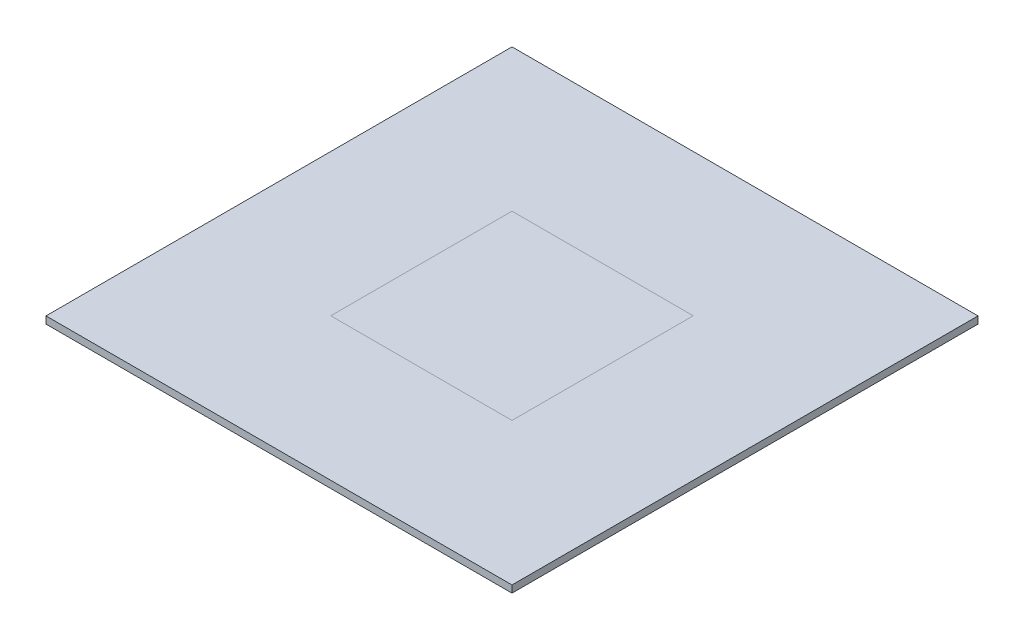
ISO-10303-21;
HEADER;
FILE_DESCRIPTION(('STEP AP214'),'2;1');
FILE_NAME('part.step','',(''),(''),'','','');
FILE_SCHEMA(('AUTOMOTIVE_DESIGN { 1 0 10303 214 1 1 1 1 }'));
ENDSEC;
DATA;
#1=APPLICATION_CONTEXT('core data for automotive mechanical design processes');
#2=APPLICATION_PROTOCOL_DEFINITION('international standard','automotive_design',2000,#1);
#3=PRODUCT_CONTEXT('',#1,'mechanical');
#4=PRODUCT('Part','Part','',(#3));
#5=PRODUCT_RELATED_PRODUCT_CATEGORY('part','',(#4));
#6=PRODUCT_DEFINITION_FORMATION('','',#4);
#7=PRODUCT_DEFINITION_CONTEXT('part definition',#1,'design');
#8=PRODUCT_DEFINITION('design','',#6,#7);
#9=PRODUCT_DEFINITION_SHAPE('','',#8);
#10=(LENGTH_UNIT() NAMED_UNIT(*) SI_UNIT(.MILLI.,.METRE.));
#11=(NAMED_UNIT(*) PLANE_ANGLE_UNIT() SI_UNIT($,.RADIAN.));
#12=(NAMED_UNIT(*) SI_UNIT($,.STERADIAN.) SOLID_ANGLE_UNIT());
#13=UNCERTAINTY_MEASURE_WITH_UNIT(LENGTH_MEASURE(1.E-05),#10,'distance_accuracy_value','');
#14=(GEOMETRIC_REPRESENTATION_CONTEXT(3) GLOBAL_UNCERTAINTY_ASSIGNED_CONTEXT((#13)) GLOBAL_UNIT_ASSIGNED_CONTEXT((#10,
#11,#12)) REPRESENTATION_CONTEXT('',''));
#15=CARTESIAN_POINT('',(0.,0.,0.));
#16=DIRECTION('',(0.,0.,1.));
#17=DIRECTION('',(1.,0.,0.));
#18=AXIS2_PLACEMENT_3D('',#15,#16,#17);
#19=CARTESIAN_POINT('',(0.,1.393,0.));
#20=DIRECTION('',(0.,1.,0.));
#21=DIRECTION('',(0.,0.,1.));
#22=AXIS2_PLACEMENT_3D('',#19,#20,#21);
#23=PLANE('',#22);
#24=DIRECTION('',(0.,0.,-1.));
#25=VECTOR('',#24,1.);
#26=CARTESIAN_POINT('',(17.5,1.393,-17.5));
#27=LINE('',#26,#25);
#28=CARTESIAN_POINT('',(17.5,1.393,17.5));
#29=VERTEX_POINT('',#28);
#30=CARTESIAN_POINT('',(17.5,1.393,-17.5));
#31=VERTEX_POINT('',#30);
#32=EDGE_CURVE('E60',#29,#31,#27,.T.);
#33=ORIENTED_EDGE('',*,*,#32,.T.);
#34=DIRECTION('',(-1.,0.,0.));
#35=VECTOR('',#34,1.);
#36=CARTESIAN_POINT('',(-17.5,1.393,-17.5));
#37=LINE('',#36,#35);
#38=CARTESIAN_POINT('',(-17.5,1.393,-17.5));
#39=VERTEX_POINT('',#38);
#40=EDGE_CURVE('E71',#31,#39,#37,.T.);
#41=ORIENTED_EDGE('',*,*,#40,.T.);
#42=DIRECTION('',(0.,0.,1.));
#43=VECTOR('',#42,1.);
#44=CARTESIAN_POINT('',(-17.5,1.393,-17.5));
#45=LINE('',#44,#43);
#46=CARTESIAN_POINT('',(-17.5,1.393,17.5));
#47=VERTEX_POINT('',#46);
#48=EDGE_CURVE('E56',#39,#47,#45,.T.);
#49=ORIENTED_EDGE('',*,*,#48,.T.);
#50=DIRECTION('',(1.,0.,0.));
#51=VECTOR('',#50,1.);
#52=CARTESIAN_POINT('',(-17.5,1.393,17.5));
#53=LINE('',#52,#51);
#54=EDGE_CURVE('E12',#47,#29,#53,.T.);
#55=ORIENTED_EDGE('',*,*,#54,.T.);
#56=EDGE_LOOP('',(#33,#41,#49,#55));
#57=FACE_BOUND('',#56,.T.);
#58=ADVANCED_FACE('F51',(#57),#23,.T.);
#59=OPEN_SHELL('',(#58));
#60=SHELL_BASED_SURFACE_MODEL('B2',(#59));
#61=CARTESIAN_POINT('',(45.,1.375,-45.));
#62=DIRECTION('',(-1.,0.,0.));
#63=DIRECTION('',(0.,0.,1.));
#64=AXIS2_PLACEMENT_3D('',#61,#62,#63);
#65=PLANE('',#64);
#66=DIRECTION('',(0.,0.,-1.));
#67=VECTOR('',#66,1.);
#68=CARTESIAN_POINT('',(45.,0.,-45.));
#69=LINE('',#68,#67);
#70=CARTESIAN_POINT('',(45.,0.,45.));
#71=VERTEX_POINT('',#70);
#72=CARTESIAN_POINT('',(45.,0.,-45.));
#73=VERTEX_POINT('',#72);
#74=EDGE_CURVE('E158',#71,#73,#69,.T.);
#75=ORIENTED_EDGE('',*,*,#74,.T.);
#76=DIRECTION('',(0.,-1.,0.));
#77=VECTOR('',#76,1.);
#78=CARTESIAN_POINT('',(45.,1.375,-45.));
#79=LINE('',#78,#77);
#80=CARTESIAN_POINT('',(45.,1.375,-45.));
#81=VERTEX_POINT('',#80);
#82=EDGE_CURVE('E49',#81,#73,#79,.T.);
#83=ORIENTED_EDGE('',*,*,#82,.F.);
#84=DIRECTION('',(0.,0.,-1.));
#85=VECTOR('',#84,1.);
#86=CARTESIAN_POINT('',(45.,1.375,-45.));
#87=LINE('',#86,#85);
#88=CARTESIAN_POINT('',(45.,1.375,45.));
#89=VERTEX_POINT('',#88);
#90=EDGE_CURVE('E146',#89,#81,#87,.T.);
#91=ORIENTED_EDGE('',*,*,#90,.F.);
#92=DIRECTION('',(0.,-1.,0.));
#93=VECTOR('',#92,1.);
#94=CARTESIAN_POINT('',(45.,1.375,45.));
#95=LINE('',#94,#93);
#96=EDGE_CURVE('E154',#89,#71,#95,.T.);
#97=ORIENTED_EDGE('',*,*,#96,.T.);
#98=EDGE_LOOP('',(#75,#83,#91,#97));
#99=FACE_BOUND('',#98,.T.);
#100=ADVANCED_FACE('F95',(#99),#65,.F.);
#101=CARTESIAN_POINT('',(-45.,1.375,-45.));
#102=DIRECTION('',(0.,0.,1.));
#103=DIRECTION('',(1.,0.,0.));
#104=AXIS2_PLACEMENT_3D('',#101,#102,#103);
#105=PLANE('',#104);
#106=DIRECTION('',(-1.,0.,0.));
#107=VECTOR('',#106,1.);
#108=CARTESIAN_POINT('',(-45.,0.,-45.));
#109=LINE('',#108,#107);
#110=CARTESIAN_POINT('',(-45.,0.,-45.));
#111=VERTEX_POINT('',#110);
#112=EDGE_CURVE('E150',#73,#111,#109,.T.);
#113=ORIENTED_EDGE('',*,*,#112,.T.);
#114=DIRECTION('',(0.,-1.,0.));
#115=VECTOR('',#114,1.);
#116=CARTESIAN_POINT('',(-45.,1.375,-45.));
#117=LINE('',#116,#115);
#118=CARTESIAN_POINT('',(-45.,1.375,-45.));
#119=VERTEX_POINT('',#118);
#120=EDGE_CURVE('E103',#119,#111,#117,.T.);
#121=ORIENTED_EDGE('',*,*,#120,.F.);
#122=DIRECTION('',(-1.,0.,0.));
#123=VECTOR('',#122,1.);
#124=CARTESIAN_POINT('',(-45.,1.375,-45.));
#125=LINE('',#124,#123);
#126=EDGE_CURVE('E141',#81,#119,#125,.T.);
#127=ORIENTED_EDGE('',*,*,#126,.F.);
#128=ORIENTED_EDGE('',*,*,#82,.T.);
#129=EDGE_LOOP('',(#113,#121,#127,#128));
#130=FACE_BOUND('',#129,.T.);
#131=ADVANCED_FACE('F149',(#130),#105,.F.);
#132=CARTESIAN_POINT('',(-45.,1.375,-45.));
#133=DIRECTION('',(1.,0.,0.));
#134=DIRECTION('',(0.,0.,-1.));
#135=AXIS2_PLACEMENT_3D('',#132,#133,#134);
#136=PLANE('',#135);
#137=DIRECTION('',(0.,0.,1.));
#138=VECTOR('',#137,1.);
#139=CARTESIAN_POINT('',(-45.,0.,-45.));
#140=LINE('',#139,#138);
#141=CARTESIAN_POINT('',(-45.,0.,45.));
#142=VERTEX_POINT('',#141);
#143=EDGE_CURVE('E128',#111,#142,#140,.T.);
#144=ORIENTED_EDGE('',*,*,#143,.T.);
#145=DIRECTION('',(0.,-1.,0.));
#146=VECTOR('',#145,1.);
#147=CARTESIAN_POINT('',(-45.,1.375,45.));
#148=LINE('',#147,#146);
#149=CARTESIAN_POINT('',(-45.,1.375,45.));
#150=VERTEX_POINT('',#149);
#151=EDGE_CURVE('E151',#150,#142,#148,.T.);
#152=ORIENTED_EDGE('',*,*,#151,.F.);
#153=DIRECTION('',(0.,0.,1.));
#154=VECTOR('',#153,1.);
#155=CARTESIAN_POINT('',(-45.,1.375,-45.));
#156=LINE('',#155,#154);
#157=EDGE_CURVE('E144',#119,#150,#156,.T.);
#158=ORIENTED_EDGE('',*,*,#157,.F.);
#159=ORIENTED_EDGE('',*,*,#120,.T.);
#160=EDGE_LOOP('',(#144,#152,#158,#159));
#161=FACE_BOUND('',#160,.T.);
#162=ADVANCED_FACE('F152',(#161),#136,.F.);
#163=CARTESIAN_POINT('',(-45.,1.375,45.));
#164=DIRECTION('',(0.,0.,-1.));
#165=DIRECTION('',(-1.,0.,0.));
#166=AXIS2_PLACEMENT_3D('',#163,#164,#165);
#167=PLANE('',#166);
#168=DIRECTION('',(1.,0.,0.));
#169=VECTOR('',#168,1.);
#170=CARTESIAN_POINT('',(-45.,0.,45.));
#171=LINE('',#170,#169);
#172=EDGE_CURVE('E134',#142,#71,#171,.T.);
#173=ORIENTED_EDGE('',*,*,#172,.T.);
#174=ORIENTED_EDGE('',*,*,#96,.F.);
#175=DIRECTION('',(1.,0.,0.));
#176=VECTOR('',#175,1.);
#177=CARTESIAN_POINT('',(-45.,1.375,45.));
#178=LINE('',#177,#176);
#179=EDGE_CURVE('E111',#150,#89,#178,.T.);
#180=ORIENTED_EDGE('',*,*,#179,.F.);
#181=ORIENTED_EDGE('',*,*,#151,.T.);
#182=EDGE_LOOP('',(#173,#174,#180,#181));
#183=FACE_BOUND('',#182,.T.);
#184=ADVANCED_FACE('F165',(#183),#167,.F.);
#185=CARTESIAN_POINT('',(0.,1.375,0.));
#186=DIRECTION('',(0.,1.,0.));
#187=DIRECTION('',(0.,0.,1.));
#188=AXIS2_PLACEMENT_3D('',#185,#186,#187);
#189=PLANE('',#188);
#190=ORIENTED_EDGE('',*,*,#90,.T.);
#191=ORIENTED_EDGE('',*,*,#126,.T.);
#192=ORIENTED_EDGE('',*,*,#157,.T.);
#193=ORIENTED_EDGE('',*,*,#179,.T.);
#194=EDGE_LOOP('',(#190,#191,#192,#193));
#195=FACE_BOUND('',#194,.T.);
#196=ADVANCED_FACE('F142',(#195),#189,.T.);
#197=CARTESIAN_POINT('',(0.,0.,0.));
#198=DIRECTION('',(0.,1.,0.));
#199=DIRECTION('',(0.,0.,1.));
#200=AXIS2_PLACEMENT_3D('',#197,#198,#199);
#201=PLANE('',#200);
#202=ORIENTED_EDGE('',*,*,#74,.F.);
#203=ORIENTED_EDGE('',*,*,#172,.F.);
#204=ORIENTED_EDGE('',*,*,#143,.F.);
#205=ORIENTED_EDGE('',*,*,#112,.F.);
#206=EDGE_LOOP('',(#202,#203,#204,#205));
#207=FACE_BOUND('',#206,.T.);
#208=ADVANCED_FACE('F168',(#207),#201,.F.);
#209=CLOSED_SHELL('',(#100,#131,#162,#184,#196,#208));
#210=MANIFOLD_SOLID_BREP('B6',#209);
#211=ADVANCED_BREP_SHAPE_REPRESENTATION('',(#18,#210),#14);
#212=MANIFOLD_SURFACE_SHAPE_REPRESENTATION('',(#18,#60),#14);
#213=SHAPE_REPRESENTATION('',(#18),#14);
#214=SHAPE_DEFINITION_REPRESENTATION(#9,#213);
#215=SHAPE_REPRESENTATION_RELATIONSHIP('','',#213,#211);
#216=SHAPE_REPRESENTATION_RELATIONSHIP('','',#213,#212);
ENDSEC;
END-ISO-10303-21;
